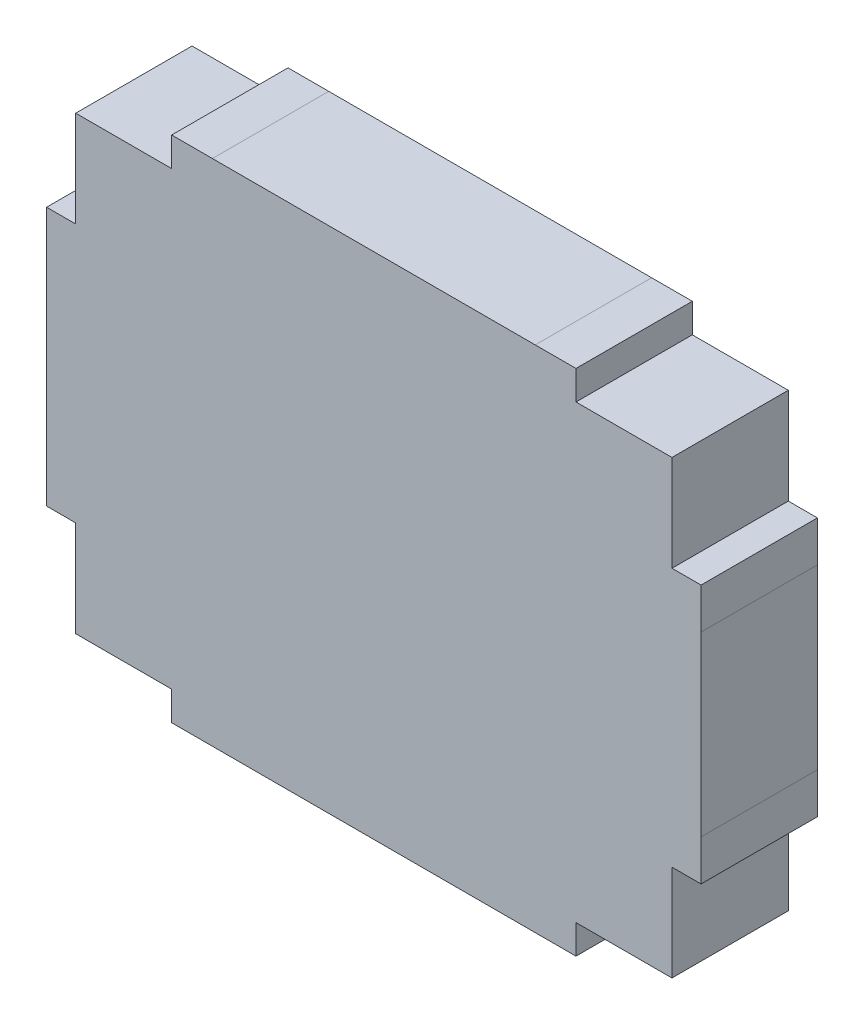
ISO-10303-21;
HEADER;
FILE_DESCRIPTION(('STEP AP214'),'2;1');
FILE_NAME('part.step','',(''),(''),'','','');
FILE_SCHEMA(('AUTOMOTIVE_DESIGN { 1 0 10303 214 1 1 1 1 }'));
ENDSEC;
DATA;
#1=APPLICATION_CONTEXT('core data for automotive mechanical design processes');
#2=APPLICATION_PROTOCOL_DEFINITION('international standard','automotive_design',2000,#1);
#3=PRODUCT_CONTEXT('',#1,'mechanical');
#4=PRODUCT('Part','Part','',(#3));
#5=PRODUCT_RELATED_PRODUCT_CATEGORY('part','',(#4));
#6=PRODUCT_DEFINITION_FORMATION('','',#4);
#7=PRODUCT_DEFINITION_CONTEXT('part definition',#1,'design');
#8=PRODUCT_DEFINITION('design','',#6,#7);
#9=PRODUCT_DEFINITION_SHAPE('','',#8);
#10=(LENGTH_UNIT() NAMED_UNIT(*) SI_UNIT(.MILLI.,.METRE.));
#11=(NAMED_UNIT(*) PLANE_ANGLE_UNIT() SI_UNIT($,.RADIAN.));
#12=(NAMED_UNIT(*) SI_UNIT($,.STERADIAN.) SOLID_ANGLE_UNIT());
#13=UNCERTAINTY_MEASURE_WITH_UNIT(LENGTH_MEASURE(1.E-05),#10,'distance_accuracy_value','');
#14=(GEOMETRIC_REPRESENTATION_CONTEXT(3) GLOBAL_UNCERTAINTY_ASSIGNED_CONTEXT((#13)) GLOBAL_UNIT_ASSIGNED_CONTEXT((#10,
#11,#12)) REPRESENTATION_CONTEXT('',''));
#15=CARTESIAN_POINT('',(0.,0.,0.));
#16=DIRECTION('',(0.,0.,1.));
#17=DIRECTION('',(1.,0.,0.));
#18=AXIS2_PLACEMENT_3D('',#15,#16,#17);
#19=CARTESIAN_POINT('',(0.,0.,0.8));
#20=DIRECTION('',(0.,0.,1.));
#21=DIRECTION('',(1.,0.,0.));
#22=AXIS2_PLACEMENT_3D('',#19,#20,#21);
#23=PLANE('',#22);
#24=DIRECTION('',(1.,0.,0.));
#25=VECTOR('',#24,1.);
#26=CARTESIAN_POINT('',(-1.39,-1.75,0.8));
#27=LINE('',#26,#25);
#28=CARTESIAN_POINT('',(-1.39,-1.75,0.8));
#29=VERTEX_POINT('',#28);
#30=CARTESIAN_POINT('',(-1.11,-1.75,0.8));
#31=VERTEX_POINT('',#30);
#32=EDGE_CURVE('E355',#29,#31,#27,.T.);
#33=ORIENTED_EDGE('',*,*,#32,.T.);
#34=DIRECTION('',(1.,0.,0.));
#35=VECTOR('',#34,1.);
#36=CARTESIAN_POINT('',(-1.11,-1.75,0.8));
#37=LINE('',#36,#35);
#38=CARTESIAN_POINT('',(1.11,-1.75,0.8));
#39=VERTEX_POINT('',#38);
#40=EDGE_CURVE('E11',#31,#39,#37,.T.);
#41=ORIENTED_EDGE('',*,*,#40,.T.);
#42=DIRECTION('',(1.,0.,0.));
#43=VECTOR('',#42,1.);
#44=CARTESIAN_POINT('',(1.11,-1.75,0.8));
#45=LINE('',#44,#43);
#46=CARTESIAN_POINT('',(1.39,-1.75,0.8));
#47=VERTEX_POINT('',#46);
#48=EDGE_CURVE('E364',#39,#47,#45,.T.);
#49=ORIENTED_EDGE('',*,*,#48,.T.);
#50=DIRECTION('',(0.,1.,0.));
#51=VECTOR('',#50,1.);
#52=CARTESIAN_POINT('',(1.39,-1.75,0.8));
#53=LINE('',#52,#51);
#54=CARTESIAN_POINT('',(1.39,-1.55,0.8));
#55=VERTEX_POINT('',#54);
#56=EDGE_CURVE('E373',#47,#55,#53,.T.);
#57=ORIENTED_EDGE('',*,*,#56,.T.);
#58=DIRECTION('',(1.,0.,0.));
#59=VECTOR('',#58,1.);
#60=CARTESIAN_POINT('',(1.39,-1.55,0.8));
#61=LINE('',#60,#59);
#62=CARTESIAN_POINT('',(2.05,-1.55,0.8));
#63=VERTEX_POINT('',#62);
#64=EDGE_CURVE('E487',#55,#63,#61,.T.);
#65=ORIENTED_EDGE('',*,*,#64,.T.);
#66=DIRECTION('',(0.,1.,0.));
#67=VECTOR('',#66,1.);
#68=CARTESIAN_POINT('',(2.05,-1.55,0.8));
#69=LINE('',#68,#67);
#70=CARTESIAN_POINT('',(2.05,-0.89,0.8));
#71=VERTEX_POINT('',#70);
#72=EDGE_CURVE('E424',#63,#71,#69,.T.);
#73=ORIENTED_EDGE('',*,*,#72,.T.);
#74=DIRECTION('',(1.,0.,0.));
#75=VECTOR('',#74,1.);
#76=CARTESIAN_POINT('',(2.05,-0.89,0.8));
#77=LINE('',#76,#75);
#78=CARTESIAN_POINT('',(2.25,-0.89,0.8));
#79=VERTEX_POINT('',#78);
#80=EDGE_CURVE('E385',#71,#79,#77,.T.);
#81=ORIENTED_EDGE('',*,*,#80,.T.);
#82=DIRECTION('',(0.,1.,0.));
#83=VECTOR('',#82,1.);
#84=CARTESIAN_POINT('',(2.25,-0.89,0.8));
#85=LINE('',#84,#83);
#86=CARTESIAN_POINT('',(2.25,-0.61,0.8));
#87=VERTEX_POINT('',#86);
#88=EDGE_CURVE('E405',#79,#87,#85,.T.);
#89=ORIENTED_EDGE('',*,*,#88,.T.);
#90=DIRECTION('',(0.,1.,0.));
#91=VECTOR('',#90,1.);
#92=CARTESIAN_POINT('',(2.25,-0.61,0.8));
#93=LINE('',#92,#91);
#94=CARTESIAN_POINT('',(2.25,0.61,0.8));
#95=VERTEX_POINT('',#94);
#96=EDGE_CURVE('E415',#87,#95,#93,.T.);
#97=ORIENTED_EDGE('',*,*,#96,.T.);
#98=DIRECTION('',(0.,1.,0.));
#99=VECTOR('',#98,1.);
#100=CARTESIAN_POINT('',(2.25,0.61,0.8));
#101=LINE('',#100,#99);
#102=CARTESIAN_POINT('',(2.25,0.89,0.8));
#103=VERTEX_POINT('',#102);
#104=EDGE_CURVE('E437',#95,#103,#101,.T.);
#105=ORIENTED_EDGE('',*,*,#104,.T.);
#106=DIRECTION('',(-1.,0.,0.));
#107=VECTOR('',#106,1.);
#108=CARTESIAN_POINT('',(2.25,0.89,0.8));
#109=LINE('',#108,#107);
#110=CARTESIAN_POINT('',(2.05,0.89,0.8));
#111=VERTEX_POINT('',#110);
#112=EDGE_CURVE('E464',#103,#111,#109,.T.);
#113=ORIENTED_EDGE('',*,*,#112,.T.);
#114=DIRECTION('',(0.,1.,0.));
#115=VECTOR('',#114,1.);
#116=CARTESIAN_POINT('',(2.05,0.89,0.8));
#117=LINE('',#116,#115);
#118=CARTESIAN_POINT('',(2.05,1.55,0.8));
#119=VERTEX_POINT('',#118);
#120=EDGE_CURVE('E333',#111,#119,#117,.T.);
#121=ORIENTED_EDGE('',*,*,#120,.T.);
#122=DIRECTION('',(-1.,0.,0.));
#123=VECTOR('',#122,1.);
#124=CARTESIAN_POINT('',(2.05,1.55,0.8));
#125=LINE('',#124,#123);
#126=CARTESIAN_POINT('',(1.39,1.55,0.8));
#127=VERTEX_POINT('',#126);
#128=EDGE_CURVE('E322',#119,#127,#125,.T.);
#129=ORIENTED_EDGE('',*,*,#128,.T.);
#130=DIRECTION('',(0.,1.,0.));
#131=VECTOR('',#130,1.);
#132=CARTESIAN_POINT('',(1.39,1.55,0.8));
#133=LINE('',#132,#131);
#134=CARTESIAN_POINT('',(1.39,1.75,0.8));
#135=VERTEX_POINT('',#134);
#136=EDGE_CURVE('E318',#127,#135,#133,.T.);
#137=ORIENTED_EDGE('',*,*,#136,.T.);
#138=DIRECTION('',(-1.,0.,0.));
#139=VECTOR('',#138,1.);
#140=CARTESIAN_POINT('',(1.39,1.75,0.8));
#141=LINE('',#140,#139);
#142=CARTESIAN_POINT('',(1.11,1.75,0.8));
#143=VERTEX_POINT('',#142);
#144=EDGE_CURVE('E344',#135,#143,#141,.T.);
#145=ORIENTED_EDGE('',*,*,#144,.T.);
#146=DIRECTION('',(-1.,0.,0.));
#147=VECTOR('',#146,1.);
#148=CARTESIAN_POINT('',(1.11,1.75,0.8));
#149=LINE('',#148,#147);
#150=CARTESIAN_POINT('',(-1.11,1.75,0.8));
#151=VERTEX_POINT('',#150);
#152=EDGE_CURVE('E257',#143,#151,#149,.T.);
#153=ORIENTED_EDGE('',*,*,#152,.T.);
#154=DIRECTION('',(-1.,0.,0.));
#155=VECTOR('',#154,1.);
#156=CARTESIAN_POINT('',(-1.11,1.75,0.8));
#157=LINE('',#156,#155);
#158=CARTESIAN_POINT('',(-1.39,1.75,0.8));
#159=VERTEX_POINT('',#158);
#160=EDGE_CURVE('E253',#151,#159,#157,.T.);
#161=ORIENTED_EDGE('',*,*,#160,.T.);
#162=DIRECTION('',(0.,-1.,0.));
#163=VECTOR('',#162,1.);
#164=CARTESIAN_POINT('',(-1.39,1.75,0.8));
#165=LINE('',#164,#163);
#166=CARTESIAN_POINT('',(-1.39,1.55,0.8));
#167=VERTEX_POINT('',#166);
#168=EDGE_CURVE('E433',#159,#167,#165,.T.);
#169=ORIENTED_EDGE('',*,*,#168,.T.);
#170=DIRECTION('',(-1.,0.,0.));
#171=VECTOR('',#170,1.);
#172=CARTESIAN_POINT('',(-1.39,1.55,0.8));
#173=LINE('',#172,#171);
#174=CARTESIAN_POINT('',(-2.05,1.55,0.8));
#175=VERTEX_POINT('',#174);
#176=EDGE_CURVE('E303',#167,#175,#173,.T.);
#177=ORIENTED_EDGE('',*,*,#176,.T.);
#178=DIRECTION('',(0.,-1.,0.));
#179=VECTOR('',#178,1.);
#180=CARTESIAN_POINT('',(-2.05,1.55,0.8));
#181=LINE('',#180,#179);
#182=CARTESIAN_POINT('',(-2.05,0.89,0.8));
#183=VERTEX_POINT('',#182);
#184=EDGE_CURVE('E299',#175,#183,#181,.T.);
#185=ORIENTED_EDGE('',*,*,#184,.T.);
#186=DIRECTION('',(-1.,0.,0.));
#187=VECTOR('',#186,1.);
#188=CARTESIAN_POINT('',(-2.05,0.89,0.8));
#189=LINE('',#188,#187);
#190=CARTESIAN_POINT('',(-2.25,0.89,0.8));
#191=VERTEX_POINT('',#190);
#192=EDGE_CURVE('E360',#183,#191,#189,.T.);
#193=ORIENTED_EDGE('',*,*,#192,.T.);
#194=DIRECTION('',(0.,-1.,0.));
#195=VECTOR('',#194,1.);
#196=CARTESIAN_POINT('',(-2.25,0.89,0.8));
#197=LINE('',#196,#195);
#198=CARTESIAN_POINT('',(-2.25,0.61,0.8));
#199=VERTEX_POINT('',#198);
#200=EDGE_CURVE('E378',#191,#199,#197,.T.);
#201=ORIENTED_EDGE('',*,*,#200,.T.);
#202=DIRECTION('',(0.,-1.,0.));
#203=VECTOR('',#202,1.);
#204=CARTESIAN_POINT('',(-2.25,0.61,0.8));
#205=LINE('',#204,#203);
#206=CARTESIAN_POINT('',(-2.25,-0.61,0.8));
#207=VERTEX_POINT('',#206);
#208=EDGE_CURVE('E379',#199,#207,#205,.T.);
#209=ORIENTED_EDGE('',*,*,#208,.T.);
#210=DIRECTION('',(0.,-1.,0.));
#211=VECTOR('',#210,1.);
#212=CARTESIAN_POINT('',(-2.25,-0.61,0.8));
#213=LINE('',#212,#211);
#214=CARTESIAN_POINT('',(-2.25,-0.89,0.8));
#215=VERTEX_POINT('',#214);
#216=EDGE_CURVE('E390',#207,#215,#213,.T.);
#217=ORIENTED_EDGE('',*,*,#216,.T.);
#218=DIRECTION('',(1.,0.,0.));
#219=VECTOR('',#218,1.);
#220=CARTESIAN_POINT('',(-2.25,-0.89,0.8));
#221=LINE('',#220,#219);
#222=CARTESIAN_POINT('',(-2.05,-0.89,0.8));
#223=VERTEX_POINT('',#222);
#224=EDGE_CURVE('E427',#215,#223,#221,.T.);
#225=ORIENTED_EDGE('',*,*,#224,.T.);
#226=DIRECTION('',(0.,-1.,0.));
#227=VECTOR('',#226,1.);
#228=CARTESIAN_POINT('',(-2.05,-0.89,0.8));
#229=LINE('',#228,#227);
#230=CARTESIAN_POINT('',(-2.05,-1.55,0.8));
#231=VERTEX_POINT('',#230);
#232=EDGE_CURVE('E517',#223,#231,#229,.T.);
#233=ORIENTED_EDGE('',*,*,#232,.T.);
#234=DIRECTION('',(1.,0.,0.));
#235=VECTOR('',#234,1.);
#236=CARTESIAN_POINT('',(-2.05,-1.55,0.8));
#237=LINE('',#236,#235);
#238=CARTESIAN_POINT('',(-1.39,-1.55,0.8));
#239=VERTEX_POINT('',#238);
#240=EDGE_CURVE('E293',#231,#239,#237,.T.);
#241=ORIENTED_EDGE('',*,*,#240,.T.);
#242=DIRECTION('',(0.,-1.,0.));
#243=VECTOR('',#242,1.);
#244=CARTESIAN_POINT('',(-1.39,-1.55,0.8));
#245=LINE('',#244,#243);
#246=EDGE_CURVE('E354',#239,#29,#245,.T.);
#247=ORIENTED_EDGE('',*,*,#246,.T.);
#248=EDGE_LOOP('',(#33,#41,#49,#57,#65,#73,#81,#89,#97,#105,#113,#121,#129,#137,#145,#153,#161,
#169,#177,#185,#193,#201,#209,#217,#225,#233,#241,#247));
#249=FACE_BOUND('',#248,.T.);
#250=ADVANCED_FACE('F17',(#249),#23,.T.);
#251=CARTESIAN_POINT('',(-1.11,-1.75,0.));
#252=DIRECTION('',(0.,-1.,0.));
#253=DIRECTION('',(0.,0.,-1.));
#254=AXIS2_PLACEMENT_3D('',#251,#252,#253);
#255=PLANE('',#254);
#256=DIRECTION('',(1.,0.,0.));
#257=VECTOR('',#256,1.);
#258=CARTESIAN_POINT('',(-1.11,-1.75,0.));
#259=LINE('',#258,#257);
#260=CARTESIAN_POINT('',(-1.11,-1.75,0.));
#261=VERTEX_POINT('',#260);
#262=CARTESIAN_POINT('',(1.11,-1.75,0.));
#263=VERTEX_POINT('',#262);
#264=EDGE_CURVE('E496',#261,#263,#259,.T.);
#265=ORIENTED_EDGE('',*,*,#264,.T.);
#266=DIRECTION('',(0.,0.,1.));
#267=VECTOR('',#266,1.);
#268=CARTESIAN_POINT('',(1.11,-1.75,0.));
#269=LINE('',#268,#267);
#270=EDGE_CURVE('E28',#263,#39,#269,.T.);
#271=ORIENTED_EDGE('',*,*,#270,.T.);
#272=ORIENTED_EDGE('',*,*,#40,.F.);
#273=DIRECTION('',(0.,0.,1.));
#274=VECTOR('',#273,1.);
#275=CARTESIAN_POINT('',(-1.11,-1.75,0.));
#276=LINE('',#275,#274);
#277=EDGE_CURVE('E493',#261,#31,#276,.T.);
#278=ORIENTED_EDGE('',*,*,#277,.F.);
#279=EDGE_LOOP('',(#265,#271,#272,#278));
#280=FACE_BOUND('',#279,.T.);
#281=ADVANCED_FACE('F888',(#280),#255,.T.);
#282=CARTESIAN_POINT('',(1.11,-1.75,0.));
#283=DIRECTION('',(0.,-1.,0.));
#284=DIRECTION('',(0.,0.,-1.));
#285=AXIS2_PLACEMENT_3D('',#282,#283,#284);
#286=PLANE('',#285);
#287=DIRECTION('',(1.,0.,0.));
#288=VECTOR('',#287,1.);
#289=CARTESIAN_POINT('',(1.11,-1.75,0.));
#290=LINE('',#289,#288);
#291=CARTESIAN_POINT('',(1.39,-1.75,0.));
#292=VERTEX_POINT('',#291);
#293=EDGE_CURVE('E477',#263,#292,#290,.T.);
#294=ORIENTED_EDGE('',*,*,#293,.T.);
#295=DIRECTION('',(0.,0.,1.));
#296=VECTOR('',#295,1.);
#297=CARTESIAN_POINT('',(1.39,-1.75,0.));
#298=LINE('',#297,#296);
#299=EDGE_CURVE('E367',#292,#47,#298,.T.);
#300=ORIENTED_EDGE('',*,*,#299,.T.);
#301=ORIENTED_EDGE('',*,*,#48,.F.);
#302=ORIENTED_EDGE('',*,*,#270,.F.);
#303=EDGE_LOOP('',(#294,#300,#301,#302));
#304=FACE_BOUND('',#303,.T.);
#305=ADVANCED_FACE('F894',(#304),#286,.T.);
#306=CARTESIAN_POINT('',(1.39,-1.75,0.));
#307=DIRECTION('',(1.,0.,0.));
#308=DIRECTION('',(0.,1.,0.));
#309=AXIS2_PLACEMENT_3D('',#306,#307,#308);
#310=PLANE('',#309);
#311=DIRECTION('',(0.,1.,0.));
#312=VECTOR('',#311,1.);
#313=CARTESIAN_POINT('',(1.39,-1.75,0.));
#314=LINE('',#313,#312);
#315=CARTESIAN_POINT('',(1.39,-1.55,0.));
#316=VERTEX_POINT('',#315);
#317=EDGE_CURVE('E473',#292,#316,#314,.T.);
#318=ORIENTED_EDGE('',*,*,#317,.T.);
#319=DIRECTION('',(0.,0.,1.));
#320=VECTOR('',#319,1.);
#321=CARTESIAN_POINT('',(1.39,-1.55,0.));
#322=LINE('',#321,#320);
#323=EDGE_CURVE('E407',#316,#55,#322,.T.);
#324=ORIENTED_EDGE('',*,*,#323,.T.);
#325=ORIENTED_EDGE('',*,*,#56,.F.);
#326=ORIENTED_EDGE('',*,*,#299,.F.);
#327=EDGE_LOOP('',(#318,#324,#325,#326));
#328=FACE_BOUND('',#327,.T.);
#329=ADVANCED_FACE('F911',(#328),#310,.T.);
#330=CARTESIAN_POINT('',(1.39,-1.55,0.));
#331=DIRECTION('',(0.,-1.,0.));
#332=DIRECTION('',(0.,0.,-1.));
#333=AXIS2_PLACEMENT_3D('',#330,#331,#332);
#334=PLANE('',#333);
#335=DIRECTION('',(1.,0.,0.));
#336=VECTOR('',#335,1.);
#337=CARTESIAN_POINT('',(1.39,-1.55,0.));
#338=LINE('',#337,#336);
#339=CARTESIAN_POINT('',(2.05,-1.55,0.));
#340=VERTEX_POINT('',#339);
#341=EDGE_CURVE('E291',#316,#340,#338,.T.);
#342=ORIENTED_EDGE('',*,*,#341,.T.);
#343=DIRECTION('',(0.,0.,1.));
#344=VECTOR('',#343,1.);
#345=CARTESIAN_POINT('',(2.05,-1.55,0.));
#346=LINE('',#345,#344);
#347=EDGE_CURVE('E490',#340,#63,#346,.T.);
#348=ORIENTED_EDGE('',*,*,#347,.T.);
#349=ORIENTED_EDGE('',*,*,#64,.F.);
#350=ORIENTED_EDGE('',*,*,#323,.F.);
#351=EDGE_LOOP('',(#342,#348,#349,#350));
#352=FACE_BOUND('',#351,.T.);
#353=ADVANCED_FACE('F832',(#352),#334,.T.);
#354=CARTESIAN_POINT('',(2.05,-1.55,0.));
#355=DIRECTION('',(1.,0.,0.));
#356=DIRECTION('',(0.,1.,0.));
#357=AXIS2_PLACEMENT_3D('',#354,#355,#356);
#358=PLANE('',#357);
#359=DIRECTION('',(0.,1.,0.));
#360=VECTOR('',#359,1.);
#361=CARTESIAN_POINT('',(2.05,-1.55,0.));
#362=LINE('',#361,#360);
#363=CARTESIAN_POINT('',(2.05,-0.89,0.));
#364=VERTEX_POINT('',#363);
#365=EDGE_CURVE('E287',#340,#364,#362,.T.);
#366=ORIENTED_EDGE('',*,*,#365,.T.);
#367=DIRECTION('',(0.,0.,1.));
#368=VECTOR('',#367,1.);
#369=CARTESIAN_POINT('',(2.05,-0.89,0.));
#370=LINE('',#369,#368);
#371=EDGE_CURVE('E388',#364,#71,#370,.T.);
#372=ORIENTED_EDGE('',*,*,#371,.T.);
#373=ORIENTED_EDGE('',*,*,#72,.F.);
#374=ORIENTED_EDGE('',*,*,#347,.F.);
#375=EDGE_LOOP('',(#366,#372,#373,#374));
#376=FACE_BOUND('',#375,.T.);
#377=ADVANCED_FACE('F839',(#376),#358,.T.);
#378=CARTESIAN_POINT('',(2.05,-0.89,0.));
#379=DIRECTION('',(0.,-1.,0.));
#380=DIRECTION('',(0.,0.,-1.));
#381=AXIS2_PLACEMENT_3D('',#378,#379,#380);
#382=PLANE('',#381);
#383=DIRECTION('',(1.,0.,0.));
#384=VECTOR('',#383,1.);
#385=CARTESIAN_POINT('',(2.05,-0.89,0.));
#386=LINE('',#385,#384);
#387=CARTESIAN_POINT('',(2.25,-0.89,0.));
#388=VERTEX_POINT('',#387);
#389=EDGE_CURVE('E292',#364,#388,#386,.T.);
#390=ORIENTED_EDGE('',*,*,#389,.T.);
#391=DIRECTION('',(0.,0.,1.));
#392=VECTOR('',#391,1.);
#393=CARTESIAN_POINT('',(2.25,-0.89,0.));
#394=LINE('',#393,#392);
#395=EDGE_CURVE('E389',#388,#79,#394,.T.);
#396=ORIENTED_EDGE('',*,*,#395,.T.);
#397=ORIENTED_EDGE('',*,*,#80,.F.);
#398=ORIENTED_EDGE('',*,*,#371,.F.);
#399=EDGE_LOOP('',(#390,#396,#397,#398));
#400=FACE_BOUND('',#399,.T.);
#401=ADVANCED_FACE('F909',(#400),#382,.T.);
#402=CARTESIAN_POINT('',(2.25,-0.89,0.));
#403=DIRECTION('',(1.,0.,0.));
#404=DIRECTION('',(0.,1.,0.));
#405=AXIS2_PLACEMENT_3D('',#402,#403,#404);
#406=PLANE('',#405);
#407=DIRECTION('',(0.,1.,0.));
#408=VECTOR('',#407,1.);
#409=CARTESIAN_POINT('',(2.25,-0.89,0.));
#410=LINE('',#409,#408);
#411=CARTESIAN_POINT('',(2.25,-0.61,0.));
#412=VERTEX_POINT('',#411);
#413=EDGE_CURVE('E401',#388,#412,#410,.T.);
#414=ORIENTED_EDGE('',*,*,#413,.T.);
#415=DIRECTION('',(0.,0.,1.));
#416=VECTOR('',#415,1.);
#417=CARTESIAN_POINT('',(2.25,-0.61,0.));
#418=LINE('',#417,#416);
#419=EDGE_CURVE('E419',#412,#87,#418,.T.);
#420=ORIENTED_EDGE('',*,*,#419,.T.);
#421=ORIENTED_EDGE('',*,*,#88,.F.);
#422=ORIENTED_EDGE('',*,*,#395,.F.);
#423=EDGE_LOOP('',(#414,#420,#421,#422));
#424=FACE_BOUND('',#423,.T.);
#425=ADVANCED_FACE('F905',(#424),#406,.T.);
#426=CARTESIAN_POINT('',(2.25,-0.61,0.));
#427=DIRECTION('',(1.,0.,0.));
#428=DIRECTION('',(0.,1.,0.));
#429=AXIS2_PLACEMENT_3D('',#426,#427,#428);
#430=PLANE('',#429);
#431=DIRECTION('',(0.,1.,0.));
#432=VECTOR('',#431,1.);
#433=CARTESIAN_POINT('',(2.25,-0.61,0.));
#434=LINE('',#433,#432);
#435=CARTESIAN_POINT('',(2.25,0.61,0.));
#436=VERTEX_POINT('',#435);
#437=EDGE_CURVE('E443',#412,#436,#434,.T.);
#438=ORIENTED_EDGE('',*,*,#437,.T.);
#439=DIRECTION('',(0.,0.,1.));
#440=VECTOR('',#439,1.);
#441=CARTESIAN_POINT('',(2.25,0.61,0.));
#442=LINE('',#441,#440);
#443=EDGE_CURVE('E420',#436,#95,#442,.T.);
#444=ORIENTED_EDGE('',*,*,#443,.T.);
#445=ORIENTED_EDGE('',*,*,#96,.F.);
#446=ORIENTED_EDGE('',*,*,#419,.F.);
#447=EDGE_LOOP('',(#438,#444,#445,#446));
#448=FACE_BOUND('',#447,.T.);
#449=ADVANCED_FACE('F908',(#448),#430,.T.);
#450=CARTESIAN_POINT('',(2.25,0.61,0.));
#451=DIRECTION('',(1.,0.,0.));
#452=DIRECTION('',(0.,1.,0.));
#453=AXIS2_PLACEMENT_3D('',#450,#451,#452);
#454=PLANE('',#453);
#455=DIRECTION('',(0.,1.,0.));
#456=VECTOR('',#455,1.);
#457=CARTESIAN_POINT('',(2.25,0.61,0.));
#458=LINE('',#457,#456);
#459=CARTESIAN_POINT('',(2.25,0.89,0.));
#460=VERTEX_POINT('',#459);
#461=EDGE_CURVE('E447',#436,#460,#458,.T.);
#462=ORIENTED_EDGE('',*,*,#461,.T.);
#463=DIRECTION('',(0.,0.,1.));
#464=VECTOR('',#463,1.);
#465=CARTESIAN_POINT('',(2.25,0.89,0.));
#466=LINE('',#465,#464);
#467=EDGE_CURVE('E467',#460,#103,#466,.T.);
#468=ORIENTED_EDGE('',*,*,#467,.T.);
#469=ORIENTED_EDGE('',*,*,#104,.F.);
#470=ORIENTED_EDGE('',*,*,#443,.F.);
#471=EDGE_LOOP('',(#462,#468,#469,#470));
#472=FACE_BOUND('',#471,.T.);
#473=ADVANCED_FACE('F941',(#472),#454,.T.);
#474=CARTESIAN_POINT('',(2.25,0.89,0.));
#475=DIRECTION('',(0.,1.,0.));
#476=DIRECTION('',(1.,0.,0.));
#477=AXIS2_PLACEMENT_3D('',#474,#475,#476);
#478=PLANE('',#477);
#479=DIRECTION('',(-1.,0.,0.));
#480=VECTOR('',#479,1.);
#481=CARTESIAN_POINT('',(2.25,0.89,0.));
#482=LINE('',#481,#480);
#483=CARTESIAN_POINT('',(2.05,0.89,0.));
#484=VERTEX_POINT('',#483);
#485=EDGE_CURVE('E525',#460,#484,#482,.T.);
#486=ORIENTED_EDGE('',*,*,#485,.T.);
#487=DIRECTION('',(0.,0.,1.));
#488=VECTOR('',#487,1.);
#489=CARTESIAN_POINT('',(2.05,0.89,0.));
#490=LINE('',#489,#488);
#491=EDGE_CURVE('E397',#484,#111,#490,.T.);
#492=ORIENTED_EDGE('',*,*,#491,.T.);
#493=ORIENTED_EDGE('',*,*,#112,.F.);
#494=ORIENTED_EDGE('',*,*,#467,.F.);
#495=EDGE_LOOP('',(#486,#492,#493,#494));
#496=FACE_BOUND('',#495,.T.);
#497=ADVANCED_FACE('F943',(#496),#478,.T.);
#498=CARTESIAN_POINT('',(2.05,0.89,0.));
#499=DIRECTION('',(1.,0.,0.));
#500=DIRECTION('',(0.,1.,0.));
#501=AXIS2_PLACEMENT_3D('',#498,#499,#500);
#502=PLANE('',#501);
#503=DIRECTION('',(0.,1.,0.));
#504=VECTOR('',#503,1.);
#505=CARTESIAN_POINT('',(2.05,0.89,0.));
#506=LINE('',#505,#504);
#507=CARTESIAN_POINT('',(2.05,1.55,0.));
#508=VERTEX_POINT('',#507);
#509=EDGE_CURVE('E383',#484,#508,#506,.T.);
#510=ORIENTED_EDGE('',*,*,#509,.T.);
#511=DIRECTION('',(0.,0.,1.));
#512=VECTOR('',#511,1.);
#513=CARTESIAN_POINT('',(2.05,1.55,0.));
#514=LINE('',#513,#512);
#515=EDGE_CURVE('E324',#508,#119,#514,.T.);
#516=ORIENTED_EDGE('',*,*,#515,.T.);
#517=ORIENTED_EDGE('',*,*,#120,.F.);
#518=ORIENTED_EDGE('',*,*,#491,.F.);
#519=EDGE_LOOP('',(#510,#516,#517,#518));
#520=FACE_BOUND('',#519,.T.);
#521=ADVANCED_FACE('F945',(#520),#502,.T.);
#522=CARTESIAN_POINT('',(2.05,1.55,0.));
#523=DIRECTION('',(0.,1.,0.));
#524=DIRECTION('',(1.,0.,0.));
#525=AXIS2_PLACEMENT_3D('',#522,#523,#524);
#526=PLANE('',#525);
#527=DIRECTION('',(-1.,0.,0.));
#528=VECTOR('',#527,1.);
#529=CARTESIAN_POINT('',(2.05,1.55,0.));
#530=LINE('',#529,#528);
#531=CARTESIAN_POINT('',(1.39,1.55,0.));
#532=VERTEX_POINT('',#531);
#533=EDGE_CURVE('E380',#508,#532,#530,.T.);
#534=ORIENTED_EDGE('',*,*,#533,.T.);
#535=DIRECTION('',(0.,0.,1.));
#536=VECTOR('',#535,1.);
#537=CARTESIAN_POINT('',(1.39,1.55,0.));
#538=LINE('',#537,#536);
#539=EDGE_CURVE('E320',#532,#127,#538,.T.);
#540=ORIENTED_EDGE('',*,*,#539,.T.);
#541=ORIENTED_EDGE('',*,*,#128,.F.);
#542=ORIENTED_EDGE('',*,*,#515,.F.);
#543=EDGE_LOOP('',(#534,#540,#541,#542));
#544=FACE_BOUND('',#543,.T.);
#545=ADVANCED_FACE('F903',(#544),#526,.T.);
#546=CARTESIAN_POINT('',(1.39,1.55,0.));
#547=DIRECTION('',(1.,0.,0.));
#548=DIRECTION('',(0.,1.,0.));
#549=AXIS2_PLACEMENT_3D('',#546,#547,#548);
#550=PLANE('',#549);
#551=DIRECTION('',(0.,1.,0.));
#552=VECTOR('',#551,1.);
#553=CARTESIAN_POINT('',(1.39,1.55,0.));
#554=LINE('',#553,#552);
#555=CARTESIAN_POINT('',(1.39,1.75,0.));
#556=VERTEX_POINT('',#555);
#557=EDGE_CURVE('E384',#532,#556,#554,.T.);
#558=ORIENTED_EDGE('',*,*,#557,.T.);
#559=DIRECTION('',(0.,0.,1.));
#560=VECTOR('',#559,1.);
#561=CARTESIAN_POINT('',(1.39,1.75,0.));
#562=LINE('',#561,#560);
#563=EDGE_CURVE('E321',#556,#135,#562,.T.);
#564=ORIENTED_EDGE('',*,*,#563,.T.);
#565=ORIENTED_EDGE('',*,*,#136,.F.);
#566=ORIENTED_EDGE('',*,*,#539,.F.);
#567=EDGE_LOOP('',(#558,#564,#565,#566));
#568=FACE_BOUND('',#567,.T.);
#569=ADVANCED_FACE('F899',(#568),#550,.T.);
#570=CARTESIAN_POINT('',(1.39,1.75,0.));
#571=DIRECTION('',(0.,1.,0.));
#572=DIRECTION('',(1.,0.,0.));
#573=AXIS2_PLACEMENT_3D('',#570,#571,#572);
#574=PLANE('',#573);
#575=DIRECTION('',(-1.,0.,0.));
#576=VECTOR('',#575,1.);
#577=CARTESIAN_POINT('',(1.39,1.75,0.));
#578=LINE('',#577,#576);
#579=CARTESIAN_POINT('',(1.11,1.75,0.));
#580=VERTEX_POINT('',#579);
#581=EDGE_CURVE('E268',#556,#580,#578,.T.);
#582=ORIENTED_EDGE('',*,*,#581,.T.);
#583=DIRECTION('',(0.,0.,1.));
#584=VECTOR('',#583,1.);
#585=CARTESIAN_POINT('',(1.11,1.75,0.));
#586=LINE('',#585,#584);
#587=EDGE_CURVE('E263',#580,#143,#586,.T.);
#588=ORIENTED_EDGE('',*,*,#587,.T.);
#589=ORIENTED_EDGE('',*,*,#144,.F.);
#590=ORIENTED_EDGE('',*,*,#563,.F.);
#591=EDGE_LOOP('',(#582,#588,#589,#590));
#592=FACE_BOUND('',#591,.T.);
#593=ADVANCED_FACE('F902',(#592),#574,.T.);
#594=CARTESIAN_POINT('',(1.11,1.75,0.));
#595=DIRECTION('',(0.,1.,0.));
#596=DIRECTION('',(1.,0.,0.));
#597=AXIS2_PLACEMENT_3D('',#594,#595,#596);
#598=PLANE('',#597);
#599=DIRECTION('',(-1.,0.,0.));
#600=VECTOR('',#599,1.);
#601=CARTESIAN_POINT('',(1.11,1.75,0.));
#602=LINE('',#601,#600);
#603=CARTESIAN_POINT('',(-1.11,1.75,0.));
#604=VERTEX_POINT('',#603);
#605=EDGE_CURVE('E260',#580,#604,#602,.T.);
#606=ORIENTED_EDGE('',*,*,#605,.T.);
#607=DIRECTION('',(0.,0.,1.));
#608=VECTOR('',#607,1.);
#609=CARTESIAN_POINT('',(-1.11,1.75,0.));
#610=LINE('',#609,#608);
#611=EDGE_CURVE('E246',#604,#151,#610,.T.);
#612=ORIENTED_EDGE('',*,*,#611,.T.);
#613=ORIENTED_EDGE('',*,*,#152,.F.);
#614=ORIENTED_EDGE('',*,*,#587,.F.);
#615=EDGE_LOOP('',(#606,#612,#613,#614));
#616=FACE_BOUND('',#615,.T.);
#617=ADVANCED_FACE('F261',(#616),#598,.T.);
#618=CARTESIAN_POINT('',(-1.11,1.75,0.));
#619=DIRECTION('',(0.,1.,0.));
#620=DIRECTION('',(1.,0.,0.));
#621=AXIS2_PLACEMENT_3D('',#618,#619,#620);
#622=PLANE('',#621);
#623=DIRECTION('',(-1.,0.,0.));
#624=VECTOR('',#623,1.);
#625=CARTESIAN_POINT('',(-1.11,1.75,0.));
#626=LINE('',#625,#624);
#627=CARTESIAN_POINT('',(-1.39,1.75,0.));
#628=VERTEX_POINT('',#627);
#629=EDGE_CURVE('E251',#604,#628,#626,.T.);
#630=ORIENTED_EDGE('',*,*,#629,.T.);
#631=DIRECTION('',(0.,0.,1.));
#632=VECTOR('',#631,1.);
#633=CARTESIAN_POINT('',(-1.39,1.75,0.));
#634=LINE('',#633,#632);
#635=EDGE_CURVE('E313',#628,#159,#634,.T.);
#636=ORIENTED_EDGE('',*,*,#635,.T.);
#637=ORIENTED_EDGE('',*,*,#160,.F.);
#638=ORIENTED_EDGE('',*,*,#611,.F.);
#639=EDGE_LOOP('',(#630,#636,#637,#638));
#640=FACE_BOUND('',#639,.T.);
#641=ADVANCED_FACE('F248',(#640),#622,.T.);
#642=CARTESIAN_POINT('',(-1.39,1.75,0.));
#643=DIRECTION('',(-1.,0.,0.));
#644=DIRECTION('',(0.,0.,1.));
#645=AXIS2_PLACEMENT_3D('',#642,#643,#644);
#646=PLANE('',#645);
#647=DIRECTION('',(0.,-1.,0.));
#648=VECTOR('',#647,1.);
#649=CARTESIAN_POINT('',(-1.39,1.75,0.));
#650=LINE('',#649,#648);
#651=CARTESIAN_POINT('',(-1.39,1.55,0.));
#652=VERTEX_POINT('',#651);
#653=EDGE_CURVE('E274',#628,#652,#650,.T.);
#654=ORIENTED_EDGE('',*,*,#653,.T.);
#655=DIRECTION('',(0.,0.,1.));
#656=VECTOR('',#655,1.);
#657=CARTESIAN_POINT('',(-1.39,1.55,0.));
#658=LINE('',#657,#656);
#659=EDGE_CURVE('E306',#652,#167,#658,.T.);
#660=ORIENTED_EDGE('',*,*,#659,.T.);
#661=ORIENTED_EDGE('',*,*,#168,.F.);
#662=ORIENTED_EDGE('',*,*,#635,.F.);
#663=EDGE_LOOP('',(#654,#660,#661,#662));
#664=FACE_BOUND('',#663,.T.);
#665=ADVANCED_FACE('F19',(#664),#646,.T.);
#666=CARTESIAN_POINT('',(-1.39,1.55,0.));
#667=DIRECTION('',(0.,1.,0.));
#668=DIRECTION('',(1.,0.,0.));
#669=AXIS2_PLACEMENT_3D('',#666,#667,#668);
#670=PLANE('',#669);
#671=DIRECTION('',(-1.,0.,0.));
#672=VECTOR('',#671,1.);
#673=CARTESIAN_POINT('',(-1.39,1.55,0.));
#674=LINE('',#673,#672);
#675=CARTESIAN_POINT('',(-2.05,1.55,0.));
#676=VERTEX_POINT('',#675);
#677=EDGE_CURVE('E281',#652,#676,#674,.T.);
#678=ORIENTED_EDGE('',*,*,#677,.T.);
#679=DIRECTION('',(0.,0.,1.));
#680=VECTOR('',#679,1.);
#681=CARTESIAN_POINT('',(-2.05,1.55,0.));
#682=LINE('',#681,#680);
#683=EDGE_CURVE('E302',#676,#175,#682,.T.);
#684=ORIENTED_EDGE('',*,*,#683,.T.);
#685=ORIENTED_EDGE('',*,*,#176,.F.);
#686=ORIENTED_EDGE('',*,*,#659,.F.);
#687=EDGE_LOOP('',(#678,#684,#685,#686));
#688=FACE_BOUND('',#687,.T.);
#689=ADVANCED_FACE('F993',(#688),#670,.T.);
#690=CARTESIAN_POINT('',(-2.05,1.55,0.));
#691=DIRECTION('',(-1.,0.,0.));
#692=DIRECTION('',(0.,0.,1.));
#693=AXIS2_PLACEMENT_3D('',#690,#691,#692);
#694=PLANE('',#693);
#695=DIRECTION('',(0.,-1.,0.));
#696=VECTOR('',#695,1.);
#697=CARTESIAN_POINT('',(-2.05,1.55,0.));
#698=LINE('',#697,#696);
#699=CARTESIAN_POINT('',(-2.05,0.89,0.));
#700=VERTEX_POINT('',#699);
#701=EDGE_CURVE('E359',#676,#700,#698,.T.);
#702=ORIENTED_EDGE('',*,*,#701,.T.);
#703=DIRECTION('',(0.,0.,1.));
#704=VECTOR('',#703,1.);
#705=CARTESIAN_POINT('',(-2.05,0.89,0.));
#706=LINE('',#705,#704);
#707=EDGE_CURVE('E21',#700,#183,#706,.T.);
#708=ORIENTED_EDGE('',*,*,#707,.T.);
#709=ORIENTED_EDGE('',*,*,#184,.F.);
#710=ORIENTED_EDGE('',*,*,#683,.F.);
#711=EDGE_LOOP('',(#702,#708,#709,#710));
#712=FACE_BOUND('',#711,.T.);
#713=ADVANCED_FACE('F550',(#712),#694,.T.);
#714=CARTESIAN_POINT('',(-2.05,0.89,0.));
#715=DIRECTION('',(0.,1.,0.));
#716=DIRECTION('',(1.,0.,0.));
#717=AXIS2_PLACEMENT_3D('',#714,#715,#716);
#718=PLANE('',#717);
#719=DIRECTION('',(-1.,0.,0.));
#720=VECTOR('',#719,1.);
#721=CARTESIAN_POINT('',(-2.05,0.89,0.));
#722=LINE('',#721,#720);
#723=CARTESIAN_POINT('',(-2.25,0.89,0.));
#724=VERTEX_POINT('',#723);
#725=EDGE_CURVE('E438',#700,#724,#722,.T.);
#726=ORIENTED_EDGE('',*,*,#725,.T.);
#727=DIRECTION('',(0.,0.,1.));
#728=VECTOR('',#727,1.);
#729=CARTESIAN_POINT('',(-2.25,0.89,0.));
#730=LINE('',#729,#728);
#731=EDGE_CURVE('E363',#724,#191,#730,.T.);
#732=ORIENTED_EDGE('',*,*,#731,.T.);
#733=ORIENTED_EDGE('',*,*,#192,.F.);
#734=ORIENTED_EDGE('',*,*,#707,.F.);
#735=EDGE_LOOP('',(#726,#732,#733,#734));
#736=FACE_BOUND('',#735,.T.);
#737=ADVANCED_FACE('F559',(#736),#718,.T.);
#738=CARTESIAN_POINT('',(-2.25,0.89,0.));
#739=DIRECTION('',(-1.,0.,0.));
#740=DIRECTION('',(0.,0.,1.));
#741=AXIS2_PLACEMENT_3D('',#738,#739,#740);
#742=PLANE('',#741);
#743=DIRECTION('',(0.,-1.,0.));
#744=VECTOR('',#743,1.);
#745=CARTESIAN_POINT('',(-2.25,0.89,0.));
#746=LINE('',#745,#744);
#747=CARTESIAN_POINT('',(-2.25,0.61,0.));
#748=VERTEX_POINT('',#747);
#749=EDGE_CURVE('E442',#724,#748,#746,.T.);
#750=ORIENTED_EDGE('',*,*,#749,.T.);
#751=DIRECTION('',(0.,0.,1.));
#752=VECTOR('',#751,1.);
#753=CARTESIAN_POINT('',(-2.25,0.61,0.));
#754=LINE('',#753,#752);
#755=EDGE_CURVE('E374',#748,#199,#754,.T.);
#756=ORIENTED_EDGE('',*,*,#755,.T.);
#757=ORIENTED_EDGE('',*,*,#200,.F.);
#758=ORIENTED_EDGE('',*,*,#731,.F.);
#759=EDGE_LOOP('',(#750,#756,#757,#758));
#760=FACE_BOUND('',#759,.T.);
#761=ADVANCED_FACE('F917',(#760),#742,.T.);
#762=CARTESIAN_POINT('',(-2.25,0.61,0.));
#763=DIRECTION('',(-1.,0.,0.));
#764=DIRECTION('',(0.,0.,1.));
#765=AXIS2_PLACEMENT_3D('',#762,#763,#764);
#766=PLANE('',#765);
#767=DIRECTION('',(0.,-1.,0.));
#768=VECTOR('',#767,1.);
#769=CARTESIAN_POINT('',(-2.25,0.61,0.));
#770=LINE('',#769,#768);
#771=CARTESIAN_POINT('',(-2.25,-0.61,0.));
#772=VERTEX_POINT('',#771);
#773=EDGE_CURVE('E317',#748,#772,#770,.T.);
#774=ORIENTED_EDGE('',*,*,#773,.T.);
#775=DIRECTION('',(0.,0.,1.));
#776=VECTOR('',#775,1.);
#777=CARTESIAN_POINT('',(-2.25,-0.61,0.));
#778=LINE('',#777,#776);
#779=EDGE_CURVE('E394',#772,#207,#778,.T.);
#780=ORIENTED_EDGE('',*,*,#779,.T.);
#781=ORIENTED_EDGE('',*,*,#208,.F.);
#782=ORIENTED_EDGE('',*,*,#755,.F.);
#783=EDGE_LOOP('',(#774,#780,#781,#782));
#784=FACE_BOUND('',#783,.T.);
#785=ADVANCED_FACE('F914',(#784),#766,.T.);
#786=CARTESIAN_POINT('',(-2.25,-0.61,0.));
#787=DIRECTION('',(-1.,0.,0.));
#788=DIRECTION('',(0.,0.,1.));
#789=AXIS2_PLACEMENT_3D('',#786,#787,#788);
#790=PLANE('',#789);
#791=DIRECTION('',(0.,-1.,0.));
#792=VECTOR('',#791,1.);
#793=CARTESIAN_POINT('',(-2.25,-0.61,0.));
#794=LINE('',#793,#792);
#795=CARTESIAN_POINT('',(-2.25,-0.89,0.));
#796=VERTEX_POINT('',#795);
#797=EDGE_CURVE('E314',#772,#796,#794,.T.);
#798=ORIENTED_EDGE('',*,*,#797,.T.);
#799=DIRECTION('',(0.,0.,1.));
#800=VECTOR('',#799,1.);
#801=CARTESIAN_POINT('',(-2.25,-0.89,0.));
#802=LINE('',#801,#800);
#803=EDGE_CURVE('E127',#796,#215,#802,.T.);
#804=ORIENTED_EDGE('',*,*,#803,.T.);
#805=ORIENTED_EDGE('',*,*,#216,.F.);
#806=ORIENTED_EDGE('',*,*,#779,.F.);
#807=EDGE_LOOP('',(#798,#804,#805,#806));
#808=FACE_BOUND('',#807,.T.);
#809=ADVANCED_FACE('F916',(#808),#790,.T.);
#810=CARTESIAN_POINT('',(-2.25,-0.89,0.));
#811=DIRECTION('',(0.,-1.,0.));
#812=DIRECTION('',(0.,0.,-1.));
#813=AXIS2_PLACEMENT_3D('',#810,#811,#812);
#814=PLANE('',#813);
#815=DIRECTION('',(1.,0.,0.));
#816=VECTOR('',#815,1.);
#817=CARTESIAN_POINT('',(-2.25,-0.89,0.));
#818=LINE('',#817,#816);
#819=CARTESIAN_POINT('',(-2.05,-0.89,0.));
#820=VERTEX_POINT('',#819);
#821=EDGE_CURVE('E285',#796,#820,#818,.T.);
#822=ORIENTED_EDGE('',*,*,#821,.T.);
#823=DIRECTION('',(0.,0.,1.));
#824=VECTOR('',#823,1.);
#825=CARTESIAN_POINT('',(-2.05,-0.89,0.));
#826=LINE('',#825,#824);
#827=EDGE_CURVE('E140',#820,#223,#826,.T.);
#828=ORIENTED_EDGE('',*,*,#827,.T.);
#829=ORIENTED_EDGE('',*,*,#224,.F.);
#830=ORIENTED_EDGE('',*,*,#803,.F.);
#831=EDGE_LOOP('',(#822,#828,#829,#830));
#832=FACE_BOUND('',#831,.T.);
#833=ADVANCED_FACE('F861',(#832),#814,.T.);
#834=CARTESIAN_POINT('',(-2.05,-0.89,0.));
#835=DIRECTION('',(-1.,0.,0.));
#836=DIRECTION('',(0.,0.,1.));
#837=AXIS2_PLACEMENT_3D('',#834,#835,#836);
#838=PLANE('',#837);
#839=DIRECTION('',(0.,-1.,0.));
#840=VECTOR('',#839,1.);
#841=CARTESIAN_POINT('',(-2.05,-0.89,0.));
#842=LINE('',#841,#840);
#843=CARTESIAN_POINT('',(-2.05,-1.55,0.));
#844=VERTEX_POINT('',#843);
#845=EDGE_CURVE('E307',#820,#844,#842,.T.);
#846=ORIENTED_EDGE('',*,*,#845,.T.);
#847=DIRECTION('',(0.,0.,1.));
#848=VECTOR('',#847,1.);
#849=CARTESIAN_POINT('',(-2.05,-1.55,0.));
#850=LINE('',#849,#848);
#851=EDGE_CURVE('E297',#844,#231,#850,.T.);
#852=ORIENTED_EDGE('',*,*,#851,.T.);
#853=ORIENTED_EDGE('',*,*,#232,.F.);
#854=ORIENTED_EDGE('',*,*,#827,.F.);
#855=EDGE_LOOP('',(#846,#852,#853,#854));
#856=FACE_BOUND('',#855,.T.);
#857=ADVANCED_FACE('F864',(#856),#838,.T.);
#858=CARTESIAN_POINT('',(-2.05,-1.55,0.));
#859=DIRECTION('',(0.,-1.,0.));
#860=DIRECTION('',(0.,0.,-1.));
#861=AXIS2_PLACEMENT_3D('',#858,#859,#860);
#862=PLANE('',#861);
#863=DIRECTION('',(1.,0.,0.));
#864=VECTOR('',#863,1.);
#865=CARTESIAN_POINT('',(-2.05,-1.55,0.));
#866=LINE('',#865,#864);
#867=CARTESIAN_POINT('',(-1.39,-1.55,0.));
#868=VERTEX_POINT('',#867);
#869=EDGE_CURVE('E310',#844,#868,#866,.T.);
#870=ORIENTED_EDGE('',*,*,#869,.T.);
#871=DIRECTION('',(0.,0.,1.));
#872=VECTOR('',#871,1.);
#873=CARTESIAN_POINT('',(-1.39,-1.55,0.));
#874=LINE('',#873,#872);
#875=EDGE_CURVE('E298',#868,#239,#874,.T.);
#876=ORIENTED_EDGE('',*,*,#875,.T.);
#877=ORIENTED_EDGE('',*,*,#240,.F.);
#878=ORIENTED_EDGE('',*,*,#851,.F.);
#879=EDGE_LOOP('',(#870,#876,#877,#878));
#880=FACE_BOUND('',#879,.T.);
#881=ADVANCED_FACE('F868',(#880),#862,.T.);
#882=CARTESIAN_POINT('',(-1.39,-1.55,0.));
#883=DIRECTION('',(-1.,0.,0.));
#884=DIRECTION('',(0.,0.,1.));
#885=AXIS2_PLACEMENT_3D('',#882,#883,#884);
#886=PLANE('',#885);
#887=DIRECTION('',(0.,-1.,0.));
#888=VECTOR('',#887,1.);
#889=CARTESIAN_POINT('',(-1.39,-1.55,0.));
#890=LINE('',#889,#888);
#891=CARTESIAN_POINT('',(-1.39,-1.75,0.));
#892=VERTEX_POINT('',#891);
#893=EDGE_CURVE('E456',#868,#892,#890,.T.);
#894=ORIENTED_EDGE('',*,*,#893,.T.);
#895=DIRECTION('',(0.,0.,1.));
#896=VECTOR('',#895,1.);
#897=CARTESIAN_POINT('',(-1.39,-1.75,0.));
#898=LINE('',#897,#896);
#899=EDGE_CURVE('E350',#892,#29,#898,.T.);
#900=ORIENTED_EDGE('',*,*,#899,.T.);
#901=ORIENTED_EDGE('',*,*,#246,.F.);
#902=ORIENTED_EDGE('',*,*,#875,.F.);
#903=EDGE_LOOP('',(#894,#900,#901,#902));
#904=FACE_BOUND('',#903,.T.);
#905=ADVANCED_FACE('F872',(#904),#886,.T.);
#906=CARTESIAN_POINT('',(-1.39,-1.75,0.));
#907=DIRECTION('',(0.,-1.,0.));
#908=DIRECTION('',(0.,0.,-1.));
#909=AXIS2_PLACEMENT_3D('',#906,#907,#908);
#910=PLANE('',#909);
#911=DIRECTION('',(1.,0.,0.));
#912=VECTOR('',#911,1.);
#913=CARTESIAN_POINT('',(-1.39,-1.75,0.));
#914=LINE('',#913,#912);
#915=EDGE_CURVE('E459',#892,#261,#914,.T.);
#916=ORIENTED_EDGE('',*,*,#915,.T.);
#917=ORIENTED_EDGE('',*,*,#277,.T.);
#918=ORIENTED_EDGE('',*,*,#32,.F.);
#919=ORIENTED_EDGE('',*,*,#899,.F.);
#920=EDGE_LOOP('',(#916,#917,#918,#919));
#921=FACE_BOUND('',#920,.T.);
#922=ADVANCED_FACE('F874',(#921),#910,.T.);
#923=CARTESIAN_POINT('',(0.,0.,0.));
#924=DIRECTION('',(0.,0.,1.));
#925=DIRECTION('',(1.,0.,0.));
#926=AXIS2_PLACEMENT_3D('',#923,#924,#925);
#927=PLANE('',#926);
#928=ORIENTED_EDGE('',*,*,#915,.F.);
#929=ORIENTED_EDGE('',*,*,#893,.F.);
#930=ORIENTED_EDGE('',*,*,#869,.F.);
#931=ORIENTED_EDGE('',*,*,#845,.F.);
#932=ORIENTED_EDGE('',*,*,#821,.F.);
#933=ORIENTED_EDGE('',*,*,#797,.F.);
#934=ORIENTED_EDGE('',*,*,#773,.F.);
#935=ORIENTED_EDGE('',*,*,#749,.F.);
#936=ORIENTED_EDGE('',*,*,#725,.F.);
#937=ORIENTED_EDGE('',*,*,#701,.F.);
#938=ORIENTED_EDGE('',*,*,#677,.F.);
#939=ORIENTED_EDGE('',*,*,#653,.F.);
#940=ORIENTED_EDGE('',*,*,#629,.F.);
#941=ORIENTED_EDGE('',*,*,#605,.F.);
#942=ORIENTED_EDGE('',*,*,#581,.F.);
#943=ORIENTED_EDGE('',*,*,#557,.F.);
#944=ORIENTED_EDGE('',*,*,#533,.F.);
#945=ORIENTED_EDGE('',*,*,#509,.F.);
#946=ORIENTED_EDGE('',*,*,#485,.F.);
#947=ORIENTED_EDGE('',*,*,#461,.F.);
#948=ORIENTED_EDGE('',*,*,#437,.F.);
#949=ORIENTED_EDGE('',*,*,#413,.F.);
#950=ORIENTED_EDGE('',*,*,#389,.F.);
#951=ORIENTED_EDGE('',*,*,#365,.F.);
#952=ORIENTED_EDGE('',*,*,#341,.F.);
#953=ORIENTED_EDGE('',*,*,#317,.F.);
#954=ORIENTED_EDGE('',*,*,#293,.F.);
#955=ORIENTED_EDGE('',*,*,#264,.F.);
#956=EDGE_LOOP('',(#928,#929,#930,#931,#932,#933,#934,#935,#936,#937,#938,#939,#940,#941,#942,
#943,#944,#945,#946,#947,#948,#949,#950,#951,#952,#953,#954,#955));
#957=FACE_BOUND('',#956,.T.);
#958=ADVANCED_FACE('F271',(#957),#927,.F.);
#959=CLOSED_SHELL('',(#250,#281,#305,#329,#353,#377,#401,#425,#449,#473,#497,#521,#545,#569,
#593,#617,#641,#665,#689,#713,#737,#761,#785,#809,#833,#857,#881,#905,#922,#958));
#960=MANIFOLD_SOLID_BREP('B1',#959);
#961=ADVANCED_BREP_SHAPE_REPRESENTATION('',(#18,#960),#14);
#962=SHAPE_DEFINITION_REPRESENTATION(#9,#961);
ENDSEC;
END-ISO-10303-21;
